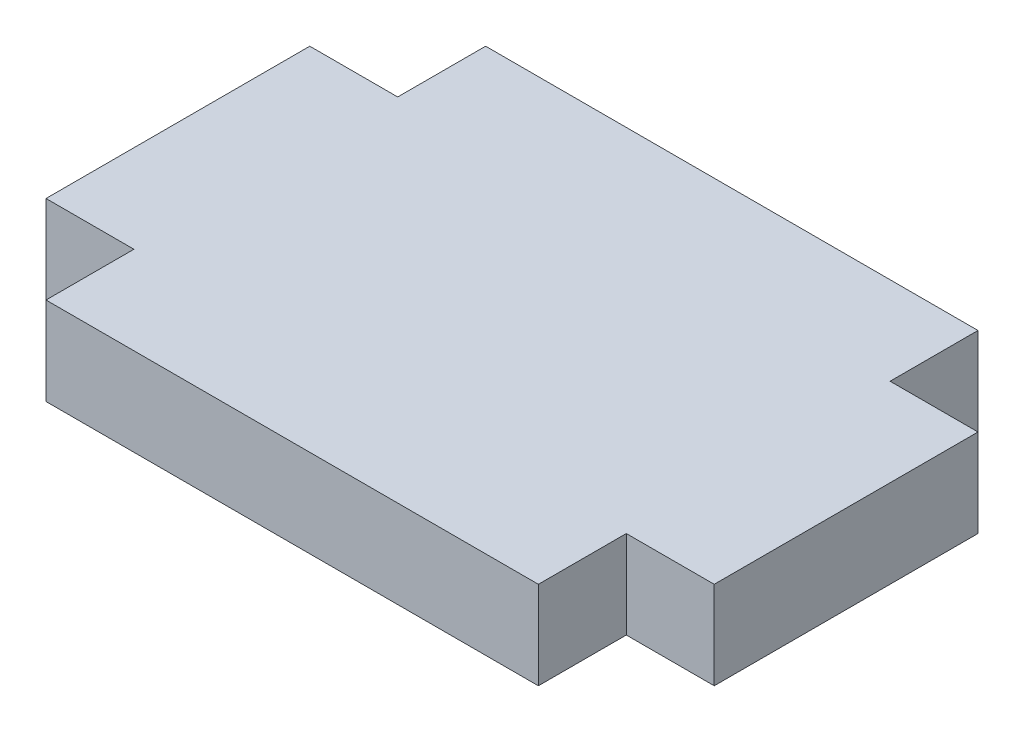
ISO-10303-21;
HEADER;
FILE_DESCRIPTION(('STEP AP214'),'2;1');
FILE_NAME('part.step','',(''),(''),'','','');
FILE_SCHEMA(('AUTOMOTIVE_DESIGN { 1 0 10303 214 1 1 1 1 }'));
ENDSEC;
DATA;
#1=APPLICATION_CONTEXT('core data for automotive mechanical design processes');
#2=APPLICATION_PROTOCOL_DEFINITION('international standard','automotive_design',2000,#1);
#3=PRODUCT_CONTEXT('',#1,'mechanical');
#4=PRODUCT('Part','Part','',(#3));
#5=PRODUCT_RELATED_PRODUCT_CATEGORY('part','',(#4));
#6=PRODUCT_DEFINITION_FORMATION('','',#4);
#7=PRODUCT_DEFINITION_CONTEXT('part definition',#1,'design');
#8=PRODUCT_DEFINITION('design','',#6,#7);
#9=PRODUCT_DEFINITION_SHAPE('','',#8);
#10=(LENGTH_UNIT() NAMED_UNIT(*) SI_UNIT(.MILLI.,.METRE.));
#11=(NAMED_UNIT(*) PLANE_ANGLE_UNIT() SI_UNIT($,.RADIAN.));
#12=(NAMED_UNIT(*) SI_UNIT($,.STERADIAN.) SOLID_ANGLE_UNIT());
#13=UNCERTAINTY_MEASURE_WITH_UNIT(LENGTH_MEASURE(1.E-05),#10,'distance_accuracy_value','');
#14=(GEOMETRIC_REPRESENTATION_CONTEXT(3) GLOBAL_UNCERTAINTY_ASSIGNED_CONTEXT((#13)) GLOBAL_UNIT_ASSIGNED_CONTEXT((#10,
#11,#12)) REPRESENTATION_CONTEXT('',''));
#15=CARTESIAN_POINT('',(0.,0.,0.));
#16=DIRECTION('',(0.,0.,1.));
#17=DIRECTION('',(1.,0.,0.));
#18=AXIS2_PLACEMENT_3D('',#15,#16,#17);
#19=CARTESIAN_POINT('',(-8.89,3.175,-4.7625));
#20=DIRECTION('',(1.,0.,0.));
#21=DIRECTION('',(0.,0.,-1.));
#22=AXIS2_PLACEMENT_3D('',#19,#20,#21);
#23=PLANE('',#22);
#24=DIRECTION('',(0.,0.,1.));
#25=VECTOR('',#24,1.);
#26=CARTESIAN_POINT('',(-8.89,0.,-4.7625));
#27=LINE('',#26,#25);
#28=CARTESIAN_POINT('',(-8.89,0.,-7.9375));
#29=VERTEX_POINT('',#28);
#30=CARTESIAN_POINT('',(-8.89,0.,-4.7625));
#31=VERTEX_POINT('',#30);
#32=EDGE_CURVE('E159',#29,#31,#27,.T.);
#33=ORIENTED_EDGE('',*,*,#32,.T.);
#34=DIRECTION('',(0.,-1.,0.));
#35=VECTOR('',#34,1.);
#36=CARTESIAN_POINT('',(-8.89,3.175,-4.7625));
#37=LINE('',#36,#35);
#38=CARTESIAN_POINT('',(-8.89,3.175,-4.7625));
#39=VERTEX_POINT('',#38);
#40=EDGE_CURVE('E11',#39,#31,#37,.T.);
#41=ORIENTED_EDGE('',*,*,#40,.F.);
#42=DIRECTION('',(0.,0.,1.));
#43=VECTOR('',#42,1.);
#44=CARTESIAN_POINT('',(-8.89,3.175,-4.7625));
#45=LINE('',#44,#43);
#46=CARTESIAN_POINT('',(-8.89,3.175,-7.9375));
#47=VERTEX_POINT('',#46);
#48=EDGE_CURVE('E181',#47,#39,#45,.T.);
#49=ORIENTED_EDGE('',*,*,#48,.F.);
#50=DIRECTION('',(0.,-1.,0.));
#51=VECTOR('',#50,1.);
#52=CARTESIAN_POINT('',(-8.89,3.175,-7.9375));
#53=LINE('',#52,#51);
#54=EDGE_CURVE('E155',#47,#29,#53,.T.);
#55=ORIENTED_EDGE('',*,*,#54,.T.);
#56=EDGE_LOOP('',(#33,#41,#49,#55));
#57=FACE_BOUND('',#56,.T.);
#58=ADVANCED_FACE('F39',(#57),#23,.F.);
#59=CARTESIAN_POINT('',(-12.065,3.175,-4.7625));
#60=DIRECTION('',(0.,0.,1.));
#61=DIRECTION('',(1.,0.,0.));
#62=AXIS2_PLACEMENT_3D('',#59,#60,#61);
#63=PLANE('',#62);
#64=DIRECTION('',(-1.,0.,0.));
#65=VECTOR('',#64,1.);
#66=CARTESIAN_POINT('',(-12.065,0.,-4.7625));
#67=LINE('',#66,#65);
#68=CARTESIAN_POINT('',(-12.065,0.,-4.7625));
#69=VERTEX_POINT('',#68);
#70=EDGE_CURVE('E162',#31,#69,#67,.T.);
#71=ORIENTED_EDGE('',*,*,#70,.T.);
#72=DIRECTION('',(0.,-1.,0.));
#73=VECTOR('',#72,1.);
#74=CARTESIAN_POINT('',(-12.065,3.175,-4.7625));
#75=LINE('',#74,#73);
#76=CARTESIAN_POINT('',(-12.065,3.175,-4.7625));
#77=VERTEX_POINT('',#76);
#78=EDGE_CURVE('E47',#77,#69,#75,.T.);
#79=ORIENTED_EDGE('',*,*,#78,.F.);
#80=DIRECTION('',(-1.,0.,0.));
#81=VECTOR('',#80,1.);
#82=CARTESIAN_POINT('',(-12.065,3.175,-4.7625));
#83=LINE('',#82,#81);
#84=EDGE_CURVE('E110',#39,#77,#83,.T.);
#85=ORIENTED_EDGE('',*,*,#84,.F.);
#86=ORIENTED_EDGE('',*,*,#40,.T.);
#87=EDGE_LOOP('',(#71,#79,#85,#86));
#88=FACE_BOUND('',#87,.T.);
#89=ADVANCED_FACE('F259',(#88),#63,.F.);
#90=CARTESIAN_POINT('',(-12.065,3.175,4.7625));
#91=DIRECTION('',(1.,0.,0.));
#92=DIRECTION('',(0.,0.,-1.));
#93=AXIS2_PLACEMENT_3D('',#90,#91,#92);
#94=PLANE('',#93);
#95=DIRECTION('',(0.,0.,1.));
#96=VECTOR('',#95,1.);
#97=CARTESIAN_POINT('',(-12.065,0.,4.7625));
#98=LINE('',#97,#96);
#99=CARTESIAN_POINT('',(-12.065,0.,4.7625));
#100=VERTEX_POINT('',#99);
#101=EDGE_CURVE('E164',#69,#100,#98,.T.);
#102=ORIENTED_EDGE('',*,*,#101,.T.);
#103=DIRECTION('',(0.,-1.,0.));
#104=VECTOR('',#103,1.);
#105=CARTESIAN_POINT('',(-12.065,3.175,4.7625));
#106=LINE('',#105,#104);
#107=CARTESIAN_POINT('',(-12.065,3.175,4.7625));
#108=VERTEX_POINT('',#107);
#109=EDGE_CURVE('E200',#108,#100,#106,.T.);
#110=ORIENTED_EDGE('',*,*,#109,.F.);
#111=DIRECTION('',(0.,0.,1.));
#112=VECTOR('',#111,1.);
#113=CARTESIAN_POINT('',(-12.065,3.175,4.7625));
#114=LINE('',#113,#112);
#115=EDGE_CURVE('E208',#77,#108,#114,.T.);
#116=ORIENTED_EDGE('',*,*,#115,.F.);
#117=ORIENTED_EDGE('',*,*,#78,.T.);
#118=EDGE_LOOP('',(#102,#110,#116,#117));
#119=FACE_BOUND('',#118,.T.);
#120=ADVANCED_FACE('F206',(#119),#94,.F.);
#121=CARTESIAN_POINT('',(-8.89,3.175,4.7625));
#122=DIRECTION('',(0.,0.,-1.));
#123=DIRECTION('',(-1.,0.,0.));
#124=AXIS2_PLACEMENT_3D('',#121,#122,#123);
#125=PLANE('',#124);
#126=DIRECTION('',(1.,0.,0.));
#127=VECTOR('',#126,1.);
#128=CARTESIAN_POINT('',(-8.89,0.,4.7625));
#129=LINE('',#128,#127);
#130=CARTESIAN_POINT('',(-8.89,0.,4.7625));
#131=VERTEX_POINT('',#130);
#132=EDGE_CURVE('E166',#100,#131,#129,.T.);
#133=ORIENTED_EDGE('',*,*,#132,.T.);
#134=DIRECTION('',(0.,-1.,0.));
#135=VECTOR('',#134,1.);
#136=CARTESIAN_POINT('',(-8.89,3.175,4.7625));
#137=LINE('',#136,#135);
#138=CARTESIAN_POINT('',(-8.89,3.175,4.7625));
#139=VERTEX_POINT('',#138);
#140=EDGE_CURVE('E197',#139,#131,#137,.T.);
#141=ORIENTED_EDGE('',*,*,#140,.F.);
#142=DIRECTION('',(1.,0.,0.));
#143=VECTOR('',#142,1.);
#144=CARTESIAN_POINT('',(-8.89,3.175,4.7625));
#145=LINE('',#144,#143);
#146=EDGE_CURVE('E226',#108,#139,#145,.T.);
#147=ORIENTED_EDGE('',*,*,#146,.F.);
#148=ORIENTED_EDGE('',*,*,#109,.T.);
#149=EDGE_LOOP('',(#133,#141,#147,#148));
#150=FACE_BOUND('',#149,.T.);
#151=ADVANCED_FACE('F217',(#150),#125,.F.);
#152=CARTESIAN_POINT('',(-8.89,3.175,7.9375));
#153=DIRECTION('',(1.,0.,0.));
#154=DIRECTION('',(0.,0.,-1.));
#155=AXIS2_PLACEMENT_3D('',#152,#153,#154);
#156=PLANE('',#155);
#157=DIRECTION('',(0.,0.,1.));
#158=VECTOR('',#157,1.);
#159=CARTESIAN_POINT('',(-8.89,0.,7.9375));
#160=LINE('',#159,#158);
#161=CARTESIAN_POINT('',(-8.89,0.,7.9375));
#162=VERTEX_POINT('',#161);
#163=EDGE_CURVE('E168',#131,#162,#160,.T.);
#164=ORIENTED_EDGE('',*,*,#163,.T.);
#165=DIRECTION('',(0.,-1.,0.));
#166=VECTOR('',#165,1.);
#167=CARTESIAN_POINT('',(-8.89,3.175,7.9375));
#168=LINE('',#167,#166);
#169=CARTESIAN_POINT('',(-8.89,3.175,7.9375));
#170=VERTEX_POINT('',#169);
#171=EDGE_CURVE('E194',#170,#162,#168,.T.);
#172=ORIENTED_EDGE('',*,*,#171,.F.);
#173=DIRECTION('',(0.,0.,1.));
#174=VECTOR('',#173,1.);
#175=CARTESIAN_POINT('',(-8.89,3.175,7.9375));
#176=LINE('',#175,#174);
#177=EDGE_CURVE('E223',#139,#170,#176,.T.);
#178=ORIENTED_EDGE('',*,*,#177,.F.);
#179=ORIENTED_EDGE('',*,*,#140,.T.);
#180=EDGE_LOOP('',(#164,#172,#178,#179));
#181=FACE_BOUND('',#180,.T.);
#182=ADVANCED_FACE('F221',(#181),#156,.F.);
#183=CARTESIAN_POINT('',(8.89,3.175,7.9375));
#184=DIRECTION('',(0.,0.,-1.));
#185=DIRECTION('',(-1.,0.,0.));
#186=AXIS2_PLACEMENT_3D('',#183,#184,#185);
#187=PLANE('',#186);
#188=DIRECTION('',(1.,0.,0.));
#189=VECTOR('',#188,1.);
#190=CARTESIAN_POINT('',(8.89,0.,7.9375));
#191=LINE('',#190,#189);
#192=CARTESIAN_POINT('',(8.89,0.,7.9375));
#193=VERTEX_POINT('',#192);
#194=EDGE_CURVE('E170',#162,#193,#191,.T.);
#195=ORIENTED_EDGE('',*,*,#194,.T.);
#196=DIRECTION('',(0.,-1.,0.));
#197=VECTOR('',#196,1.);
#198=CARTESIAN_POINT('',(8.89,3.175,7.9375));
#199=LINE('',#198,#197);
#200=CARTESIAN_POINT('',(8.89,3.175,7.9375));
#201=VERTEX_POINT('',#200);
#202=EDGE_CURVE('E191',#201,#193,#199,.T.);
#203=ORIENTED_EDGE('',*,*,#202,.F.);
#204=DIRECTION('',(1.,0.,0.));
#205=VECTOR('',#204,1.);
#206=CARTESIAN_POINT('',(8.89,3.175,7.9375));
#207=LINE('',#206,#205);
#208=EDGE_CURVE('E225',#170,#201,#207,.T.);
#209=ORIENTED_EDGE('',*,*,#208,.F.);
#210=ORIENTED_EDGE('',*,*,#171,.T.);
#211=EDGE_LOOP('',(#195,#203,#209,#210));
#212=FACE_BOUND('',#211,.T.);
#213=ADVANCED_FACE('F272',(#212),#187,.F.);
#214=CARTESIAN_POINT('',(8.89,3.175,4.7625));
#215=DIRECTION('',(-1.,0.,0.));
#216=DIRECTION('',(0.,0.,1.));
#217=AXIS2_PLACEMENT_3D('',#214,#215,#216);
#218=PLANE('',#217);
#219=DIRECTION('',(0.,0.,-1.));
#220=VECTOR('',#219,1.);
#221=CARTESIAN_POINT('',(8.89,0.,4.7625));
#222=LINE('',#221,#220);
#223=CARTESIAN_POINT('',(8.89,0.,4.7625));
#224=VERTEX_POINT('',#223);
#225=EDGE_CURVE('E172',#193,#224,#222,.T.);
#226=ORIENTED_EDGE('',*,*,#225,.T.);
#227=DIRECTION('',(0.,-1.,0.));
#228=VECTOR('',#227,1.);
#229=CARTESIAN_POINT('',(8.89,3.175,4.7625));
#230=LINE('',#229,#228);
#231=CARTESIAN_POINT('',(8.89,3.175,4.7625));
#232=VERTEX_POINT('',#231);
#233=EDGE_CURVE('E188',#232,#224,#230,.T.);
#234=ORIENTED_EDGE('',*,*,#233,.F.);
#235=DIRECTION('',(0.,0.,-1.));
#236=VECTOR('',#235,1.);
#237=CARTESIAN_POINT('',(8.89,3.175,4.7625));
#238=LINE('',#237,#236);
#239=EDGE_CURVE('E228',#201,#232,#238,.T.);
#240=ORIENTED_EDGE('',*,*,#239,.F.);
#241=ORIENTED_EDGE('',*,*,#202,.T.);
#242=EDGE_LOOP('',(#226,#234,#240,#241));
#243=FACE_BOUND('',#242,.T.);
#244=ADVANCED_FACE('F275',(#243),#218,.F.);
#245=CARTESIAN_POINT('',(12.065,3.175,4.7625));
#246=DIRECTION('',(0.,0.,-1.));
#247=DIRECTION('',(-1.,0.,0.));
#248=AXIS2_PLACEMENT_3D('',#245,#246,#247);
#249=PLANE('',#248);
#250=DIRECTION('',(1.,0.,0.));
#251=VECTOR('',#250,1.);
#252=CARTESIAN_POINT('',(12.065,0.,4.7625));
#253=LINE('',#252,#251);
#254=CARTESIAN_POINT('',(12.065,0.,4.7625));
#255=VERTEX_POINT('',#254);
#256=EDGE_CURVE('E174',#224,#255,#253,.T.);
#257=ORIENTED_EDGE('',*,*,#256,.T.);
#258=DIRECTION('',(0.,-1.,0.));
#259=VECTOR('',#258,1.);
#260=CARTESIAN_POINT('',(12.065,3.175,4.7625));
#261=LINE('',#260,#259);
#262=CARTESIAN_POINT('',(12.065,3.175,4.7625));
#263=VERTEX_POINT('',#262);
#264=EDGE_CURVE('E185',#263,#255,#261,.T.);
#265=ORIENTED_EDGE('',*,*,#264,.F.);
#266=DIRECTION('',(1.,0.,0.));
#267=VECTOR('',#266,1.);
#268=CARTESIAN_POINT('',(12.065,3.175,4.7625));
#269=LINE('',#268,#267);
#270=EDGE_CURVE('E234',#232,#263,#269,.T.);
#271=ORIENTED_EDGE('',*,*,#270,.F.);
#272=ORIENTED_EDGE('',*,*,#233,.T.);
#273=EDGE_LOOP('',(#257,#265,#271,#272));
#274=FACE_BOUND('',#273,.T.);
#275=ADVANCED_FACE('F240',(#274),#249,.F.);
#276=CARTESIAN_POINT('',(12.065,3.175,-4.7625));
#277=DIRECTION('',(-1.,0.,0.));
#278=DIRECTION('',(0.,0.,1.));
#279=AXIS2_PLACEMENT_3D('',#276,#277,#278);
#280=PLANE('',#279);
#281=DIRECTION('',(0.,0.,-1.));
#282=VECTOR('',#281,1.);
#283=CARTESIAN_POINT('',(12.065,0.,-4.7625));
#284=LINE('',#283,#282);
#285=CARTESIAN_POINT('',(12.065,0.,-4.7625));
#286=VERTEX_POINT('',#285);
#287=EDGE_CURVE('E176',#255,#286,#284,.T.);
#288=ORIENTED_EDGE('',*,*,#287,.T.);
#289=DIRECTION('',(0.,-1.,0.));
#290=VECTOR('',#289,1.);
#291=CARTESIAN_POINT('',(12.065,3.175,-4.7625));
#292=LINE('',#291,#290);
#293=CARTESIAN_POINT('',(12.065,3.175,-4.7625));
#294=VERTEX_POINT('',#293);
#295=EDGE_CURVE('E150',#294,#286,#292,.T.);
#296=ORIENTED_EDGE('',*,*,#295,.F.);
#297=DIRECTION('',(0.,0.,-1.));
#298=VECTOR('',#297,1.);
#299=CARTESIAN_POINT('',(12.065,3.175,-4.7625));
#300=LINE('',#299,#298);
#301=EDGE_CURVE('E141',#263,#294,#300,.T.);
#302=ORIENTED_EDGE('',*,*,#301,.F.);
#303=ORIENTED_EDGE('',*,*,#264,.T.);
#304=EDGE_LOOP('',(#288,#296,#302,#303));
#305=FACE_BOUND('',#304,.T.);
#306=ADVANCED_FACE('F244',(#305),#280,.F.);
#307=CARTESIAN_POINT('',(8.89,3.175,-4.7625));
#308=DIRECTION('',(0.,0.,1.));
#309=DIRECTION('',(1.,0.,0.));
#310=AXIS2_PLACEMENT_3D('',#307,#308,#309);
#311=PLANE('',#310);
#312=DIRECTION('',(-1.,0.,0.));
#313=VECTOR('',#312,1.);
#314=CARTESIAN_POINT('',(8.89,0.,-4.7625));
#315=LINE('',#314,#313);
#316=CARTESIAN_POINT('',(8.89,0.,-4.7625));
#317=VERTEX_POINT('',#316);
#318=EDGE_CURVE('E149',#286,#317,#315,.T.);
#319=ORIENTED_EDGE('',*,*,#318,.T.);
#320=DIRECTION('',(0.,-1.,0.));
#321=VECTOR('',#320,1.);
#322=CARTESIAN_POINT('',(8.89,3.175,-4.7625));
#323=LINE('',#322,#321);
#324=CARTESIAN_POINT('',(8.89,3.175,-4.7625));
#325=VERTEX_POINT('',#324);
#326=EDGE_CURVE('E146',#325,#317,#323,.T.);
#327=ORIENTED_EDGE('',*,*,#326,.F.);
#328=DIRECTION('',(-1.,0.,0.));
#329=VECTOR('',#328,1.);
#330=CARTESIAN_POINT('',(8.89,3.175,-4.7625));
#331=LINE('',#330,#329);
#332=EDGE_CURVE('E135',#294,#325,#331,.T.);
#333=ORIENTED_EDGE('',*,*,#332,.F.);
#334=ORIENTED_EDGE('',*,*,#295,.T.);
#335=EDGE_LOOP('',(#319,#327,#333,#334));
#336=FACE_BOUND('',#335,.T.);
#337=ADVANCED_FACE('F147',(#336),#311,.F.);
#338=CARTESIAN_POINT('',(8.89,3.175,-7.9375));
#339=DIRECTION('',(-1.,0.,0.));
#340=DIRECTION('',(0.,0.,1.));
#341=AXIS2_PLACEMENT_3D('',#338,#339,#340);
#342=PLANE('',#341);
#343=DIRECTION('',(0.,0.,-1.));
#344=VECTOR('',#343,1.);
#345=CARTESIAN_POINT('',(8.89,0.,-7.9375));
#346=LINE('',#345,#344);
#347=CARTESIAN_POINT('',(8.89,0.,-7.9375));
#348=VERTEX_POINT('',#347);
#349=EDGE_CURVE('E96',#317,#348,#346,.T.);
#350=ORIENTED_EDGE('',*,*,#349,.T.);
#351=DIRECTION('',(0.,-1.,0.));
#352=VECTOR('',#351,1.);
#353=CARTESIAN_POINT('',(8.89,3.175,-7.9375));
#354=LINE('',#353,#352);
#355=CARTESIAN_POINT('',(8.89,3.175,-7.9375));
#356=VERTEX_POINT('',#355);
#357=EDGE_CURVE('E151',#356,#348,#354,.T.);
#358=ORIENTED_EDGE('',*,*,#357,.F.);
#359=DIRECTION('',(0.,0.,-1.));
#360=VECTOR('',#359,1.);
#361=CARTESIAN_POINT('',(8.89,3.175,-7.9375));
#362=LINE('',#361,#360);
#363=EDGE_CURVE('E139',#325,#356,#362,.T.);
#364=ORIENTED_EDGE('',*,*,#363,.F.);
#365=ORIENTED_EDGE('',*,*,#326,.T.);
#366=EDGE_LOOP('',(#350,#358,#364,#365));
#367=FACE_BOUND('',#366,.T.);
#368=ADVANCED_FACE('F153',(#367),#342,.F.);
#369=CARTESIAN_POINT('',(-8.89,3.175,-7.9375));
#370=DIRECTION('',(0.,0.,1.));
#371=DIRECTION('',(1.,0.,0.));
#372=AXIS2_PLACEMENT_3D('',#369,#370,#371);
#373=PLANE('',#372);
#374=DIRECTION('',(-1.,0.,0.));
#375=VECTOR('',#374,1.);
#376=CARTESIAN_POINT('',(-8.89,0.,-7.9375));
#377=LINE('',#376,#375);
#378=EDGE_CURVE('E102',#348,#29,#377,.T.);
#379=ORIENTED_EDGE('',*,*,#378,.T.);
#380=ORIENTED_EDGE('',*,*,#54,.F.);
#381=DIRECTION('',(-1.,0.,0.));
#382=VECTOR('',#381,1.);
#383=CARTESIAN_POINT('',(-8.89,3.175,-7.9375));
#384=LINE('',#383,#382);
#385=EDGE_CURVE('E55',#356,#47,#384,.T.);
#386=ORIENTED_EDGE('',*,*,#385,.F.);
#387=ORIENTED_EDGE('',*,*,#357,.T.);
#388=EDGE_LOOP('',(#379,#380,#386,#387));
#389=FACE_BOUND('',#388,.T.);
#390=ADVANCED_FACE('F248',(#389),#373,.F.);
#391=CARTESIAN_POINT('',(0.,3.175,0.));
#392=DIRECTION('',(0.,-1.,0.));
#393=DIRECTION('',(0.,0.,-1.));
#394=AXIS2_PLACEMENT_3D('',#391,#392,#393);
#395=PLANE('',#394);
#396=ORIENTED_EDGE('',*,*,#48,.T.);
#397=ORIENTED_EDGE('',*,*,#84,.T.);
#398=ORIENTED_EDGE('',*,*,#115,.T.);
#399=ORIENTED_EDGE('',*,*,#146,.T.);
#400=ORIENTED_EDGE('',*,*,#177,.T.);
#401=ORIENTED_EDGE('',*,*,#208,.T.);
#402=ORIENTED_EDGE('',*,*,#239,.T.);
#403=ORIENTED_EDGE('',*,*,#270,.T.);
#404=ORIENTED_EDGE('',*,*,#301,.T.);
#405=ORIENTED_EDGE('',*,*,#332,.T.);
#406=ORIENTED_EDGE('',*,*,#363,.T.);
#407=ORIENTED_EDGE('',*,*,#385,.T.);
#408=EDGE_LOOP('',(#396,#397,#398,#399,#400,#401,#402,#403,#404,#405,#406,#407));
#409=FACE_BOUND('',#408,.T.);
#410=ADVANCED_FACE('F137',(#409),#395,.F.);
#411=CARTESIAN_POINT('',(0.,0.,0.));
#412=DIRECTION('',(0.,-1.,0.));
#413=DIRECTION('',(0.,0.,-1.));
#414=AXIS2_PLACEMENT_3D('',#411,#412,#413);
#415=PLANE('',#414);
#416=ORIENTED_EDGE('',*,*,#32,.F.);
#417=ORIENTED_EDGE('',*,*,#378,.F.);
#418=ORIENTED_EDGE('',*,*,#349,.F.);
#419=ORIENTED_EDGE('',*,*,#318,.F.);
#420=ORIENTED_EDGE('',*,*,#287,.F.);
#421=ORIENTED_EDGE('',*,*,#256,.F.);
#422=ORIENTED_EDGE('',*,*,#225,.F.);
#423=ORIENTED_EDGE('',*,*,#194,.F.);
#424=ORIENTED_EDGE('',*,*,#163,.F.);
#425=ORIENTED_EDGE('',*,*,#132,.F.);
#426=ORIENTED_EDGE('',*,*,#101,.F.);
#427=ORIENTED_EDGE('',*,*,#70,.F.);
#428=EDGE_LOOP('',(#416,#417,#418,#419,#420,#421,#422,#423,#424,#425,#426,#427));
#429=FACE_BOUND('',#428,.T.);
#430=ADVANCED_FACE('F212',(#429),#415,.T.);
#431=CLOSED_SHELL('',(#58,#89,#120,#151,#182,#213,#244,#275,#306,#337,#368,#390,#410,#430));
#432=MANIFOLD_SOLID_BREP('B2',#431);
#433=ADVANCED_BREP_SHAPE_REPRESENTATION('',(#18,#432),#14);
#434=SHAPE_DEFINITION_REPRESENTATION(#9,#433);
ENDSEC;
END-ISO-10303-21;
